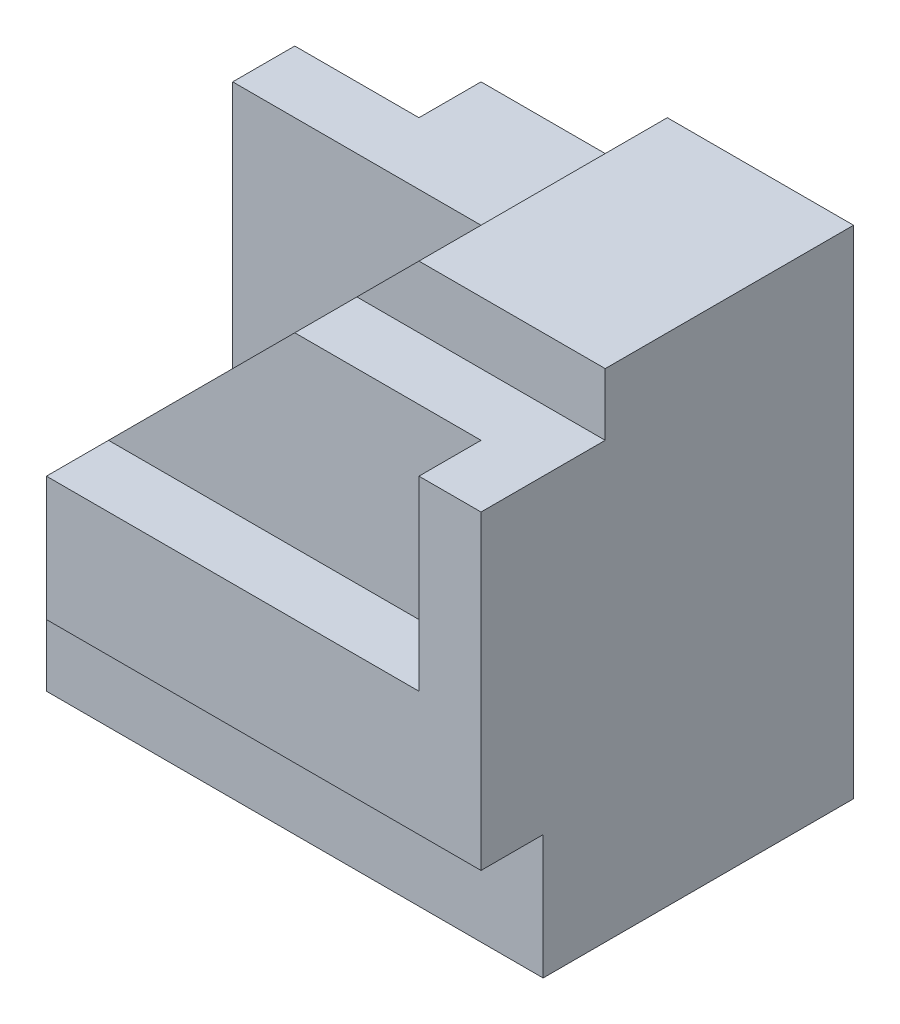
ISO-10303-21;
HEADER;
FILE_DESCRIPTION(('STEP AP214'),'2;1');
FILE_NAME('part.step','',(''),(''),'','','');
FILE_SCHEMA(('AUTOMOTIVE_DESIGN { 1 0 10303 214 1 1 1 1 }'));
ENDSEC;
DATA;
#1=APPLICATION_CONTEXT('core data for automotive mechanical design processes');
#2=APPLICATION_PROTOCOL_DEFINITION('international standard','automotive_design',2000,#1);
#3=PRODUCT_CONTEXT('',#1,'mechanical');
#4=PRODUCT('Part','Part','',(#3));
#5=PRODUCT_RELATED_PRODUCT_CATEGORY('part','',(#4));
#6=PRODUCT_DEFINITION_FORMATION('','',#4);
#7=PRODUCT_DEFINITION_CONTEXT('part definition',#1,'design');
#8=PRODUCT_DEFINITION('design','',#6,#7);
#9=PRODUCT_DEFINITION_SHAPE('','',#8);
#10=(LENGTH_UNIT() NAMED_UNIT(*) SI_UNIT(.MILLI.,.METRE.));
#11=(NAMED_UNIT(*) PLANE_ANGLE_UNIT() SI_UNIT($,.RADIAN.));
#12=(NAMED_UNIT(*) SI_UNIT($,.STERADIAN.) SOLID_ANGLE_UNIT());
#13=UNCERTAINTY_MEASURE_WITH_UNIT(LENGTH_MEASURE(1.E-05),#10,'distance_accuracy_value','');
#14=(GEOMETRIC_REPRESENTATION_CONTEXT(3) GLOBAL_UNCERTAINTY_ASSIGNED_CONTEXT((#13)) GLOBAL_UNIT_ASSIGNED_CONTEXT((#10,
#11,#12)) REPRESENTATION_CONTEXT('',''));
#15=CARTESIAN_POINT('',(0.,0.,0.));
#16=DIRECTION('',(0.,0.,1.));
#17=DIRECTION('',(1.,0.,0.));
#18=AXIS2_PLACEMENT_3D('',#15,#16,#17);
#19=CARTESIAN_POINT('',(-4.,8.,3.));
#20=DIRECTION('',(1.,0.,0.));
#21=DIRECTION('',(0.,0.,-1.));
#22=AXIS2_PLACEMENT_3D('',#19,#20,#21);
#23=PLANE('',#22);
#24=DIRECTION('',(0.,1.,0.));
#25=VECTOR('',#24,1.);
#26=CARTESIAN_POINT('',(-4.,2.,0.));
#27=LINE('',#26,#25);
#28=CARTESIAN_POINT('',(-4.,0.,0.));
#29=VERTEX_POINT('',#28);
#30=CARTESIAN_POINT('',(-4.,2.,0.));
#31=VERTEX_POINT('',#30);
#32=EDGE_CURVE('E289',#29,#31,#27,.T.);
#33=ORIENTED_EDGE('',*,*,#32,.F.);
#34=DIRECTION('',(0.,0.,1.));
#35=VECTOR('',#34,1.);
#36=CARTESIAN_POINT('',(-4.,0.,3.));
#37=LINE('',#36,#35);
#38=CARTESIAN_POINT('',(-4.,0.,2.));
#39=VERTEX_POINT('',#38);
#40=EDGE_CURVE('E273',#29,#39,#37,.T.);
#41=ORIENTED_EDGE('',*,*,#40,.T.);
#42=DIRECTION('',(0.,-1.,0.));
#43=VECTOR('',#42,1.);
#44=CARTESIAN_POINT('',(-4.,0.,2.));
#45=LINE('',#44,#43);
#46=CARTESIAN_POINT('',(-4.,2.,2.));
#47=VERTEX_POINT('',#46);
#48=EDGE_CURVE('E250',#47,#39,#45,.T.);
#49=ORIENTED_EDGE('',*,*,#48,.F.);
#50=DIRECTION('',(0.,0.,1.));
#51=VECTOR('',#50,1.);
#52=CARTESIAN_POINT('',(-4.,2.,3.));
#53=LINE('',#52,#51);
#54=EDGE_CURVE('E287',#31,#47,#53,.T.);
#55=ORIENTED_EDGE('',*,*,#54,.F.);
#56=EDGE_LOOP('',(#33,#41,#49,#55));
#57=FACE_BOUND('',#56,.T.);
#58=ADVANCED_FACE('F33',(#57),#23,.F.);
#59=CARTESIAN_POINT('',(-4.,8.,3.));
#60=DIRECTION('',(0.,0.,-1.));
#61=DIRECTION('',(-1.,0.,0.));
#62=AXIS2_PLACEMENT_3D('',#59,#60,#61);
#63=PLANE('',#62);
#64=DIRECTION('',(0.,1.,0.));
#65=VECTOR('',#64,1.);
#66=CARTESIAN_POINT('',(-3.,2.,3.));
#67=LINE('',#66,#65);
#68=CARTESIAN_POINT('',(-3.,2.,3.));
#69=VERTEX_POINT('',#68);
#70=CARTESIAN_POINT('',(-3.,4.,3.));
#71=VERTEX_POINT('',#70);
#72=EDGE_CURVE('E301',#69,#71,#67,.T.);
#73=ORIENTED_EDGE('',*,*,#72,.F.);
#74=DIRECTION('',(-1.,0.,0.));
#75=VECTOR('',#74,1.);
#76=CARTESIAN_POINT('',(4.,2.,3.));
#77=LINE('',#76,#75);
#78=CARTESIAN_POINT('',(4.,2.,3.));
#79=VERTEX_POINT('',#78);
#80=EDGE_CURVE('E257',#79,#69,#77,.T.);
#81=ORIENTED_EDGE('',*,*,#80,.F.);
#82=DIRECTION('',(0.,-1.,0.));
#83=VECTOR('',#82,1.);
#84=CARTESIAN_POINT('',(4.,8.,3.));
#85=LINE('',#84,#83);
#86=CARTESIAN_POINT('',(4.,7.,3.));
#87=VERTEX_POINT('',#86);
#88=EDGE_CURVE('E276',#87,#79,#85,.T.);
#89=ORIENTED_EDGE('',*,*,#88,.F.);
#90=DIRECTION('',(1.,0.,0.));
#91=VECTOR('',#90,1.);
#92=CARTESIAN_POINT('',(4.,7.,3.));
#93=LINE('',#92,#91);
#94=CARTESIAN_POINT('',(3.,7.,3.));
#95=VERTEX_POINT('',#94);
#96=EDGE_CURVE('E219',#95,#87,#93,.T.);
#97=ORIENTED_EDGE('',*,*,#96,.F.);
#98=DIRECTION('',(0.,1.,0.));
#99=VECTOR('',#98,1.);
#100=CARTESIAN_POINT('',(3.,8.,3.));
#101=LINE('',#100,#99);
#102=CARTESIAN_POINT('',(3.,4.,3.));
#103=VERTEX_POINT('',#102);
#104=EDGE_CURVE('E237',#103,#95,#101,.T.);
#105=ORIENTED_EDGE('',*,*,#104,.F.);
#106=DIRECTION('',(1.,0.,0.));
#107=VECTOR('',#106,1.);
#108=CARTESIAN_POINT('',(3.,4.,3.));
#109=LINE('',#108,#107);
#110=EDGE_CURVE('E242',#71,#103,#109,.T.);
#111=ORIENTED_EDGE('',*,*,#110,.F.);
#112=EDGE_LOOP('',(#73,#81,#89,#97,#105,#111));
#113=FACE_BOUND('',#112,.T.);
#114=ADVANCED_FACE('F410',(#113),#63,.F.);
#115=CARTESIAN_POINT('',(4.,2.,3.));
#116=DIRECTION('',(0.,1.,0.));
#117=DIRECTION('',(0.,0.,1.));
#118=AXIS2_PLACEMENT_3D('',#115,#116,#117);
#119=PLANE('',#118);
#120=DIRECTION('',(0.,0.,1.));
#121=VECTOR('',#120,1.);
#122=CARTESIAN_POINT('',(-3.,2.,3.));
#123=LINE('',#122,#121);
#124=CARTESIAN_POINT('',(-3.,2.,2.));
#125=VERTEX_POINT('',#124);
#126=EDGE_CURVE('E308',#125,#69,#123,.T.);
#127=ORIENTED_EDGE('',*,*,#126,.F.);
#128=DIRECTION('',(-1.,0.,0.));
#129=VECTOR('',#128,1.);
#130=CARTESIAN_POINT('',(4.,2.,2.));
#131=LINE('',#130,#129);
#132=CARTESIAN_POINT('',(4.,2.,2.));
#133=VERTEX_POINT('',#132);
#134=EDGE_CURVE('E264',#133,#125,#131,.T.);
#135=ORIENTED_EDGE('',*,*,#134,.F.);
#136=DIRECTION('',(0.,0.,-1.));
#137=VECTOR('',#136,1.);
#138=CARTESIAN_POINT('',(4.,2.,3.));
#139=LINE('',#138,#137);
#140=EDGE_CURVE('E251',#79,#133,#139,.T.);
#141=ORIENTED_EDGE('',*,*,#140,.F.);
#142=ORIENTED_EDGE('',*,*,#80,.T.);
#143=EDGE_LOOP('',(#127,#135,#141,#142));
#144=FACE_BOUND('',#143,.T.);
#145=ADVANCED_FACE('F407',(#144),#119,.F.);
#146=CARTESIAN_POINT('',(3.,4.,2.));
#147=DIRECTION('',(0.,-1.,0.));
#148=DIRECTION('',(0.,0.,-1.));
#149=AXIS2_PLACEMENT_3D('',#146,#147,#148);
#150=PLANE('',#149);
#151=DIRECTION('',(0.,0.,-1.));
#152=VECTOR('',#151,1.);
#153=CARTESIAN_POINT('',(-3.,4.,3.));
#154=LINE('',#153,#152);
#155=CARTESIAN_POINT('',(-3.,4.,2.));
#156=VERTEX_POINT('',#155);
#157=EDGE_CURVE('E303',#71,#156,#154,.T.);
#158=ORIENTED_EDGE('',*,*,#157,.F.);
#159=ORIENTED_EDGE('',*,*,#110,.T.);
#160=DIRECTION('',(0.,0.,1.));
#161=VECTOR('',#160,1.);
#162=CARTESIAN_POINT('',(3.,4.,2.));
#163=LINE('',#162,#161);
#164=CARTESIAN_POINT('',(3.,4.,2.));
#165=VERTEX_POINT('',#164);
#166=EDGE_CURVE('E244',#165,#103,#163,.T.);
#167=ORIENTED_EDGE('',*,*,#166,.F.);
#168=DIRECTION('',(1.,0.,0.));
#169=VECTOR('',#168,1.);
#170=CARTESIAN_POINT('',(3.,4.,2.));
#171=LINE('',#170,#169);
#172=EDGE_CURVE('E241',#156,#165,#171,.T.);
#173=ORIENTED_EDGE('',*,*,#172,.F.);
#174=EDGE_LOOP('',(#158,#159,#167,#173));
#175=FACE_BOUND('',#174,.T.);
#176=ADVANCED_FACE('F333',(#175),#150,.F.);
#177=CARTESIAN_POINT('',(0.,8.,0.));
#178=DIRECTION('',(0.,-1.,0.));
#179=DIRECTION('',(0.,0.,-1.));
#180=AXIS2_PLACEMENT_3D('',#177,#178,#179);
#181=PLANE('',#180);
#182=DIRECTION('',(-1.,0.,0.));
#183=VECTOR('',#182,1.);
#184=CARTESIAN_POINT('',(-4.,8.,-3.));
#185=LINE('',#184,#183);
#186=CARTESIAN_POINT('',(4.,8.,-3.));
#187=VERTEX_POINT('',#186);
#188=CARTESIAN_POINT('',(1.,8.,-3.));
#189=VERTEX_POINT('',#188);
#190=EDGE_CURVE('E272',#187,#189,#185,.T.);
#191=ORIENTED_EDGE('',*,*,#190,.T.);
#192=DIRECTION('',(0.,0.,1.));
#193=VECTOR('',#192,1.);
#194=CARTESIAN_POINT('',(1.,8.,-1.));
#195=LINE('',#194,#193);
#196=CARTESIAN_POINT('',(1.,8.,1.));
#197=VERTEX_POINT('',#196);
#198=EDGE_CURVE('E213',#189,#197,#195,.T.);
#199=ORIENTED_EDGE('',*,*,#198,.T.);
#200=DIRECTION('',(-1.,0.,0.));
#201=VECTOR('',#200,1.);
#202=CARTESIAN_POINT('',(4.,8.,1.));
#203=LINE('',#202,#201);
#204=CARTESIAN_POINT('',(4.,8.,1.));
#205=VERTEX_POINT('',#204);
#206=EDGE_CURVE('E224',#205,#197,#203,.T.);
#207=ORIENTED_EDGE('',*,*,#206,.F.);
#208=DIRECTION('',(0.,0.,-1.));
#209=VECTOR('',#208,1.);
#210=CARTESIAN_POINT('',(4.,8.,3.));
#211=LINE('',#210,#209);
#212=EDGE_CURVE('E270',#205,#187,#211,.T.);
#213=ORIENTED_EDGE('',*,*,#212,.T.);
#214=EDGE_LOOP('',(#191,#199,#207,#213));
#215=FACE_BOUND('',#214,.T.);
#216=ADVANCED_FACE('F346',(#215),#181,.F.);
#217=CARTESIAN_POINT('',(0.,0.,2.));
#218=DIRECTION('',(0.,0.,-1.));
#219=DIRECTION('',(-1.,0.,0.));
#220=AXIS2_PLACEMENT_3D('',#217,#218,#219);
#221=PLANE('',#220);
#222=DIRECTION('',(-1.,0.,0.));
#223=VECTOR('',#222,1.);
#224=CARTESIAN_POINT('',(0.,7.,2.));
#225=LINE('',#224,#223);
#226=CARTESIAN_POINT('',(3.,7.,2.));
#227=VERTEX_POINT('',#226);
#228=CARTESIAN_POINT('',(0.,7.,2.));
#229=VERTEX_POINT('',#228);
#230=EDGE_CURVE('E42',#227,#229,#225,.T.);
#231=ORIENTED_EDGE('',*,*,#230,.T.);
#232=DIRECTION('',(-0.707106781186548,-0.707106781186548,0.));
#233=VECTOR('',#232,1.);
#234=CARTESIAN_POINT('',(-3.5,3.5,2.));
#235=LINE('',#234,#233);
#236=EDGE_CURVE('E209',#229,#156,#235,.T.);
#237=ORIENTED_EDGE('',*,*,#236,.T.);
#238=ORIENTED_EDGE('',*,*,#172,.T.);
#239=DIRECTION('',(0.,1.,0.));
#240=VECTOR('',#239,1.);
#241=CARTESIAN_POINT('',(3.,8.,2.));
#242=LINE('',#241,#240);
#243=EDGE_CURVE('E238',#165,#227,#242,.T.);
#244=ORIENTED_EDGE('',*,*,#243,.T.);
#245=EDGE_LOOP('',(#231,#237,#238,#244));
#246=FACE_BOUND('',#245,.T.);
#247=ADVANCED_FACE('F337',(#246),#221,.F.);
#248=CARTESIAN_POINT('',(4.,8.,3.));
#249=DIRECTION('',(-1.,0.,0.));
#250=DIRECTION('',(0.,0.,1.));
#251=AXIS2_PLACEMENT_3D('',#248,#249,#250);
#252=PLANE('',#251);
#253=DIRECTION('',(0.,1.,0.));
#254=VECTOR('',#253,1.);
#255=CARTESIAN_POINT('',(4.,8.,1.));
#256=LINE('',#255,#254);
#257=CARTESIAN_POINT('',(4.,7.,1.));
#258=VERTEX_POINT('',#257);
#259=EDGE_CURVE('E222',#258,#205,#256,.T.);
#260=ORIENTED_EDGE('',*,*,#259,.F.);
#261=DIRECTION('',(0.,0.,1.));
#262=VECTOR('',#261,1.);
#263=CARTESIAN_POINT('',(4.,7.,1.));
#264=LINE('',#263,#262);
#265=EDGE_CURVE('E230',#258,#87,#264,.T.);
#266=ORIENTED_EDGE('',*,*,#265,.T.);
#267=ORIENTED_EDGE('',*,*,#88,.T.);
#268=ORIENTED_EDGE('',*,*,#140,.T.);
#269=DIRECTION('',(0.,-1.,0.));
#270=VECTOR('',#269,1.);
#271=CARTESIAN_POINT('',(4.,0.,2.));
#272=LINE('',#271,#270);
#273=CARTESIAN_POINT('',(4.,0.,2.));
#274=VERTEX_POINT('',#273);
#275=EDGE_CURVE('E254',#133,#274,#272,.T.);
#276=ORIENTED_EDGE('',*,*,#275,.T.);
#277=DIRECTION('',(0.,0.,-1.));
#278=VECTOR('',#277,1.);
#279=CARTESIAN_POINT('',(4.,0.,3.));
#280=LINE('',#279,#278);
#281=CARTESIAN_POINT('',(4.,0.,-3.));
#282=VERTEX_POINT('',#281);
#283=EDGE_CURVE('E263',#274,#282,#280,.T.);
#284=ORIENTED_EDGE('',*,*,#283,.T.);
#285=DIRECTION('',(0.,-1.,0.));
#286=VECTOR('',#285,1.);
#287=CARTESIAN_POINT('',(4.,8.,-3.));
#288=LINE('',#287,#286);
#289=EDGE_CURVE('E340',#187,#282,#288,.T.);
#290=ORIENTED_EDGE('',*,*,#289,.F.);
#291=ORIENTED_EDGE('',*,*,#212,.F.);
#292=EDGE_LOOP('',(#260,#266,#267,#268,#276,#284,#290,#291));
#293=FACE_BOUND('',#292,.T.);
#294=ADVANCED_FACE('F35',(#293),#252,.F.);
#295=CARTESIAN_POINT('',(-4.,8.,-3.));
#296=DIRECTION('',(0.,0.,1.));
#297=DIRECTION('',(1.,0.,0.));
#298=AXIS2_PLACEMENT_3D('',#295,#296,#297);
#299=PLANE('',#298);
#300=DIRECTION('',(0.,-1.,0.));
#301=VECTOR('',#300,1.);
#302=CARTESIAN_POINT('',(-5.,0.,-3.));
#303=LINE('',#302,#301);
#304=CARTESIAN_POINT('',(-5.,4.,-3.));
#305=VERTEX_POINT('',#304);
#306=CARTESIAN_POINT('',(-5.,0.,-3.));
#307=VERTEX_POINT('',#306);
#308=EDGE_CURVE('E293',#305,#307,#303,.T.);
#309=ORIENTED_EDGE('',*,*,#308,.F.);
#310=DIRECTION('',(-0.707106781186548,-0.707106781186548,0.));
#311=VECTOR('',#310,1.);
#312=CARTESIAN_POINT('',(-2.,7.,-3.));
#313=LINE('',#312,#311);
#314=CARTESIAN_POINT('',(-2.,7.,-3.));
#315=VERTEX_POINT('',#314);
#316=EDGE_CURVE('E358',#315,#305,#313,.T.);
#317=ORIENTED_EDGE('',*,*,#316,.F.);
#318=DIRECTION('',(-1.,0.,0.));
#319=VECTOR('',#318,1.);
#320=CARTESIAN_POINT('',(-2.,7.,-3.));
#321=LINE('',#320,#319);
#322=CARTESIAN_POINT('',(0.,7.,-3.));
#323=VERTEX_POINT('',#322);
#324=EDGE_CURVE('E195',#323,#315,#321,.T.);
#325=ORIENTED_EDGE('',*,*,#324,.F.);
#326=DIRECTION('',(0.707106781186547,0.707106781186548,0.));
#327=VECTOR('',#326,1.);
#328=CARTESIAN_POINT('',(0.,7.,-3.));
#329=LINE('',#328,#327);
#330=EDGE_CURVE('E183',#323,#189,#329,.T.);
#331=ORIENTED_EDGE('',*,*,#330,.T.);
#332=ORIENTED_EDGE('',*,*,#190,.F.);
#333=ORIENTED_EDGE('',*,*,#289,.T.);
#334=DIRECTION('',(-1.,0.,0.));
#335=VECTOR('',#334,1.);
#336=CARTESIAN_POINT('',(-4.,0.,-3.));
#337=LINE('',#336,#335);
#338=EDGE_CURVE('E278',#282,#307,#337,.T.);
#339=ORIENTED_EDGE('',*,*,#338,.T.);
#340=EDGE_LOOP('',(#309,#317,#325,#331,#332,#333,#339));
#341=FACE_BOUND('',#340,.T.);
#342=ADVANCED_FACE('F357',(#341),#299,.F.);
#343=CARTESIAN_POINT('',(0.,0.,0.));
#344=DIRECTION('',(0.,-1.,0.));
#345=DIRECTION('',(0.,0.,-1.));
#346=AXIS2_PLACEMENT_3D('',#343,#344,#345);
#347=PLANE('',#346);
#348=DIRECTION('',(-1.,0.,0.));
#349=VECTOR('',#348,1.);
#350=CARTESIAN_POINT('',(4.,0.,2.));
#351=LINE('',#350,#349);
#352=EDGE_CURVE('E260',#274,#39,#351,.T.);
#353=ORIENTED_EDGE('',*,*,#352,.T.);
#354=ORIENTED_EDGE('',*,*,#40,.F.);
#355=DIRECTION('',(1.,0.,0.));
#356=VECTOR('',#355,1.);
#357=CARTESIAN_POINT('',(-5.,0.,0.));
#358=LINE('',#357,#356);
#359=CARTESIAN_POINT('',(-5.,0.,0.));
#360=VERTEX_POINT('',#359);
#361=EDGE_CURVE('E382',#360,#29,#358,.T.);
#362=ORIENTED_EDGE('',*,*,#361,.F.);
#363=DIRECTION('',(0.,0.,1.));
#364=VECTOR('',#363,1.);
#365=CARTESIAN_POINT('',(-5.,0.,0.));
#366=LINE('',#365,#364);
#367=EDGE_CURVE('E375',#307,#360,#366,.T.);
#368=ORIENTED_EDGE('',*,*,#367,.F.);
#369=ORIENTED_EDGE('',*,*,#338,.F.);
#370=ORIENTED_EDGE('',*,*,#283,.F.);
#371=EDGE_LOOP('',(#353,#354,#362,#368,#369,#370));
#372=FACE_BOUND('',#371,.T.);
#373=ADVANCED_FACE('F399',(#372),#347,.T.);
#374=CARTESIAN_POINT('',(4.,0.,2.));
#375=DIRECTION('',(0.,0.,-1.));
#376=DIRECTION('',(-1.,0.,0.));
#377=AXIS2_PLACEMENT_3D('',#374,#375,#376);
#378=PLANE('',#377);
#379=ORIENTED_EDGE('',*,*,#48,.T.);
#380=ORIENTED_EDGE('',*,*,#352,.F.);
#381=ORIENTED_EDGE('',*,*,#275,.F.);
#382=ORIENTED_EDGE('',*,*,#134,.T.);
#383=EDGE_CURVE('E267',#125,#47,#131,.T.);
#384=ORIENTED_EDGE('',*,*,#383,.T.);
#385=EDGE_LOOP('',(#379,#380,#381,#382,#384));
#386=FACE_BOUND('',#385,.T.);
#387=ADVANCED_FACE('F395',(#386),#378,.F.);
#388=CARTESIAN_POINT('',(3.,8.,2.));
#389=DIRECTION('',(1.,0.,0.));
#390=DIRECTION('',(0.,1.,0.));
#391=AXIS2_PLACEMENT_3D('',#388,#389,#390);
#392=PLANE('',#391);
#393=ORIENTED_EDGE('',*,*,#104,.T.);
#394=DIRECTION('',(0.,0.,-1.));
#395=VECTOR('',#394,1.);
#396=CARTESIAN_POINT('',(3.,7.,2.));
#397=LINE('',#396,#395);
#398=EDGE_CURVE('E234',#95,#227,#397,.T.);
#399=ORIENTED_EDGE('',*,*,#398,.T.);
#400=ORIENTED_EDGE('',*,*,#243,.F.);
#401=ORIENTED_EDGE('',*,*,#166,.T.);
#402=EDGE_LOOP('',(#393,#399,#400,#401));
#403=FACE_BOUND('',#402,.T.);
#404=ADVANCED_FACE('F452',(#403),#392,.F.);
#405=CARTESIAN_POINT('',(4.,7.,1.));
#406=DIRECTION('',(0.,-1.,0.));
#407=DIRECTION('',(0.,0.,-1.));
#408=AXIS2_PLACEMENT_3D('',#405,#406,#407);
#409=PLANE('',#408);
#410=ORIENTED_EDGE('',*,*,#96,.T.);
#411=ORIENTED_EDGE('',*,*,#265,.F.);
#412=DIRECTION('',(1.,0.,0.));
#413=VECTOR('',#412,1.);
#414=CARTESIAN_POINT('',(4.,7.,1.));
#415=LINE('',#414,#413);
#416=CARTESIAN_POINT('',(0.,7.,1.));
#417=VERTEX_POINT('',#416);
#418=EDGE_CURVE('E227',#417,#258,#415,.T.);
#419=ORIENTED_EDGE('',*,*,#418,.F.);
#420=DIRECTION('',(0.,0.,-1.));
#421=VECTOR('',#420,1.);
#422=CARTESIAN_POINT('',(0.,7.,2.));
#423=LINE('',#422,#421);
#424=EDGE_CURVE('E206',#229,#417,#423,.T.);
#425=ORIENTED_EDGE('',*,*,#424,.F.);
#426=ORIENTED_EDGE('',*,*,#230,.F.);
#427=ORIENTED_EDGE('',*,*,#398,.F.);
#428=EDGE_LOOP('',(#410,#411,#419,#425,#426,#427));
#429=FACE_BOUND('',#428,.T.);
#430=ADVANCED_FACE('F342',(#429),#409,.F.);
#431=CARTESIAN_POINT('',(0.,0.,1.));
#432=DIRECTION('',(0.,0.,-1.));
#433=DIRECTION('',(-1.,0.,0.));
#434=AXIS2_PLACEMENT_3D('',#431,#432,#433);
#435=PLANE('',#434);
#436=ORIENTED_EDGE('',*,*,#259,.T.);
#437=ORIENTED_EDGE('',*,*,#206,.T.);
#438=DIRECTION('',(-0.707106781186548,-0.707106781186548,0.));
#439=VECTOR('',#438,1.);
#440=CARTESIAN_POINT('',(-3.5,3.5,1.));
#441=LINE('',#440,#439);
#442=EDGE_CURVE('E11',#197,#417,#441,.T.);
#443=ORIENTED_EDGE('',*,*,#442,.T.);
#444=ORIENTED_EDGE('',*,*,#418,.T.);
#445=EDGE_LOOP('',(#436,#437,#443,#444));
#446=FACE_BOUND('',#445,.T.);
#447=ADVANCED_FACE('F349',(#446),#435,.F.);
#448=CARTESIAN_POINT('',(-3.5,3.5,-1.));
#449=DIRECTION('',(-0.707106781186547,0.707106781186547,0.));
#450=DIRECTION('',(-0.707106781186548,-0.707106781186548,0.));
#451=AXIS2_PLACEMENT_3D('',#448,#449,#450);
#452=PLANE('',#451);
#453=ORIENTED_EDGE('',*,*,#442,.F.);
#454=ORIENTED_EDGE('',*,*,#198,.F.);
#455=ORIENTED_EDGE('',*,*,#330,.F.);
#456=DIRECTION('',(0.,0.,1.));
#457=VECTOR('',#456,1.);
#458=CARTESIAN_POINT('',(0.,7.,-3.));
#459=LINE('',#458,#457);
#460=CARTESIAN_POINT('',(0.,7.,-1.));
#461=VERTEX_POINT('',#460);
#462=EDGE_CURVE('E203',#323,#461,#459,.T.);
#463=ORIENTED_EDGE('',*,*,#462,.T.);
#464=DIRECTION('',(-0.707106781186548,-0.707106781186548,0.));
#465=VECTOR('',#464,1.);
#466=CARTESIAN_POINT('',(-3.5,3.5,-1.));
#467=LINE('',#466,#465);
#468=CARTESIAN_POINT('',(-3.,4.,-1.));
#469=VERTEX_POINT('',#468);
#470=EDGE_CURVE('E210',#461,#469,#467,.T.);
#471=ORIENTED_EDGE('',*,*,#470,.T.);
#472=DIRECTION('',(0.,0.,1.));
#473=VECTOR('',#472,1.);
#474=CARTESIAN_POINT('',(-3.,4.,-1.));
#475=LINE('',#474,#473);
#476=EDGE_CURVE('E216',#469,#156,#475,.T.);
#477=ORIENTED_EDGE('',*,*,#476,.T.);
#478=ORIENTED_EDGE('',*,*,#236,.F.);
#479=ORIENTED_EDGE('',*,*,#424,.T.);
#480=EDGE_LOOP('',(#453,#454,#455,#463,#471,#477,#478,#479));
#481=FACE_BOUND('',#480,.T.);
#482=ADVANCED_FACE('F322',(#481),#452,.T.);
#483=CARTESIAN_POINT('',(0.,0.,-1.));
#484=DIRECTION('',(0.,0.,1.));
#485=DIRECTION('',(1.,0.,0.));
#486=AXIS2_PLACEMENT_3D('',#483,#484,#485);
#487=PLANE('',#486);
#488=DIRECTION('',(0.,1.,0.));
#489=VECTOR('',#488,1.);
#490=CARTESIAN_POINT('',(-4.,2.,-1.));
#491=LINE('',#490,#489);
#492=CARTESIAN_POINT('',(-4.,2.,-1.));
#493=VERTEX_POINT('',#492);
#494=CARTESIAN_POINT('',(-4.,7.,-1.));
#495=VERTEX_POINT('',#494);
#496=EDGE_CURVE('E369',#493,#495,#491,.T.);
#497=ORIENTED_EDGE('',*,*,#496,.F.);
#498=DIRECTION('',(-1.,0.,0.));
#499=VECTOR('',#498,1.);
#500=CARTESIAN_POINT('',(-3.,2.,-1.));
#501=LINE('',#500,#499);
#502=CARTESIAN_POINT('',(-3.,2.,-1.));
#503=VERTEX_POINT('',#502);
#504=EDGE_CURVE('E311',#503,#493,#501,.T.);
#505=ORIENTED_EDGE('',*,*,#504,.F.);
#506=DIRECTION('',(0.,-1.,0.));
#507=VECTOR('',#506,1.);
#508=CARTESIAN_POINT('',(-3.,2.,-1.));
#509=LINE('',#508,#507);
#510=EDGE_CURVE('E305',#469,#503,#509,.T.);
#511=ORIENTED_EDGE('',*,*,#510,.F.);
#512=ORIENTED_EDGE('',*,*,#470,.F.);
#513=DIRECTION('',(1.,0.,0.));
#514=VECTOR('',#513,1.);
#515=CARTESIAN_POINT('',(0.,7.,-1.));
#516=LINE('',#515,#514);
#517=EDGE_CURVE('E197',#495,#461,#516,.T.);
#518=ORIENTED_EDGE('',*,*,#517,.F.);
#519=EDGE_LOOP('',(#497,#505,#511,#512,#518));
#520=FACE_BOUND('',#519,.T.);
#521=ADVANCED_FACE('F323',(#520),#487,.T.);
#522=CARTESIAN_POINT('',(-4.,7.,-2.));
#523=DIRECTION('',(0.,0.,-1.));
#524=DIRECTION('',(-1.,0.,0.));
#525=AXIS2_PLACEMENT_3D('',#522,#523,#524);
#526=PLANE('',#525);
#527=DIRECTION('',(0.,1.,0.));
#528=VECTOR('',#527,1.);
#529=CARTESIAN_POINT('',(-4.,2.,-2.));
#530=LINE('',#529,#528);
#531=CARTESIAN_POINT('',(-4.,2.,-2.));
#532=VERTEX_POINT('',#531);
#533=CARTESIAN_POINT('',(-4.,5.,-2.));
#534=VERTEX_POINT('',#533);
#535=EDGE_CURVE('E294',#532,#534,#530,.T.);
#536=ORIENTED_EDGE('',*,*,#535,.T.);
#537=DIRECTION('',(-0.707106781186548,-0.707106781186548,0.));
#538=VECTOR('',#537,1.);
#539=CARTESIAN_POINT('',(-2.,7.,-2.));
#540=LINE('',#539,#538);
#541=CARTESIAN_POINT('',(-5.,4.,-2.));
#542=VERTEX_POINT('',#541);
#543=EDGE_CURVE('E189',#534,#542,#540,.T.);
#544=ORIENTED_EDGE('',*,*,#543,.T.);
#545=DIRECTION('',(0.,1.,0.));
#546=VECTOR('',#545,1.);
#547=CARTESIAN_POINT('',(-5.,8.,-2.));
#548=LINE('',#547,#546);
#549=CARTESIAN_POINT('',(-5.,2.,-2.));
#550=VERTEX_POINT('',#549);
#551=EDGE_CURVE('E58',#550,#542,#548,.T.);
#552=ORIENTED_EDGE('',*,*,#551,.F.);
#553=DIRECTION('',(-1.,0.,0.));
#554=VECTOR('',#553,1.);
#555=CARTESIAN_POINT('',(-5.,2.,-2.));
#556=LINE('',#555,#554);
#557=EDGE_CURVE('E366',#532,#550,#556,.T.);
#558=ORIENTED_EDGE('',*,*,#557,.F.);
#559=EDGE_LOOP('',(#536,#544,#552,#558));
#560=FACE_BOUND('',#559,.T.);
#561=ADVANCED_FACE('F414',(#560),#526,.F.);
#562=CARTESIAN_POINT('',(0.,7.,0.));
#563=DIRECTION('',(0.,-1.,0.));
#564=DIRECTION('',(0.,0.,-1.));
#565=AXIS2_PLACEMENT_3D('',#562,#563,#564);
#566=PLANE('',#565);
#567=DIRECTION('',(-1.,0.,0.));
#568=VECTOR('',#567,1.);
#569=CARTESIAN_POINT('',(-4.,7.,-2.));
#570=LINE('',#569,#568);
#571=CARTESIAN_POINT('',(-2.,7.,-2.));
#572=VERTEX_POINT('',#571);
#573=CARTESIAN_POINT('',(-4.,7.,-2.));
#574=VERTEX_POINT('',#573);
#575=EDGE_CURVE('E175',#572,#574,#570,.T.);
#576=ORIENTED_EDGE('',*,*,#575,.T.);
#577=DIRECTION('',(0.,0.,-1.));
#578=VECTOR('',#577,1.);
#579=CARTESIAN_POINT('',(-4.,7.,-2.));
#580=LINE('',#579,#578);
#581=EDGE_CURVE('E316',#495,#574,#580,.T.);
#582=ORIENTED_EDGE('',*,*,#581,.F.);
#583=ORIENTED_EDGE('',*,*,#517,.T.);
#584=ORIENTED_EDGE('',*,*,#462,.F.);
#585=ORIENTED_EDGE('',*,*,#324,.T.);
#586=DIRECTION('',(0.,0.,1.));
#587=VECTOR('',#586,1.);
#588=CARTESIAN_POINT('',(-2.,7.,-2.));
#589=LINE('',#588,#587);
#590=EDGE_CURVE('E184',#315,#572,#589,.T.);
#591=ORIENTED_EDGE('',*,*,#590,.T.);
#592=EDGE_LOOP('',(#576,#582,#583,#584,#585,#591));
#593=FACE_BOUND('',#592,.T.);
#594=ADVANCED_FACE('F193',(#593),#566,.F.);
#595=CARTESIAN_POINT('',(-3.,2.,3.));
#596=DIRECTION('',(0.,-1.,0.));
#597=DIRECTION('',(0.,0.,-1.));
#598=AXIS2_PLACEMENT_3D('',#595,#596,#597);
#599=PLANE('',#598);
#600=EDGE_CURVE('E309',#503,#125,#123,.T.);
#601=ORIENTED_EDGE('',*,*,#600,.F.);
#602=ORIENTED_EDGE('',*,*,#504,.T.);
#603=DIRECTION('',(0.,0.,-1.));
#604=VECTOR('',#603,1.);
#605=CARTESIAN_POINT('',(-4.,2.,-2.));
#606=LINE('',#605,#604);
#607=EDGE_CURVE('E363',#493,#532,#606,.T.);
#608=ORIENTED_EDGE('',*,*,#607,.T.);
#609=ORIENTED_EDGE('',*,*,#557,.T.);
#610=DIRECTION('',(0.,0.,-1.));
#611=VECTOR('',#610,1.);
#612=CARTESIAN_POINT('',(-5.,2.,-1.));
#613=LINE('',#612,#611);
#614=CARTESIAN_POINT('',(-5.,2.,0.));
#615=VERTEX_POINT('',#614);
#616=EDGE_CURVE('E378',#615,#550,#613,.T.);
#617=ORIENTED_EDGE('',*,*,#616,.F.);
#618=DIRECTION('',(1.,0.,0.));
#619=VECTOR('',#618,1.);
#620=CARTESIAN_POINT('',(-5.,2.,0.));
#621=LINE('',#620,#619);
#622=EDGE_CURVE('E295',#615,#31,#621,.T.);
#623=ORIENTED_EDGE('',*,*,#622,.T.);
#624=ORIENTED_EDGE('',*,*,#54,.T.);
#625=ORIENTED_EDGE('',*,*,#383,.F.);
#626=EDGE_LOOP('',(#601,#602,#608,#609,#617,#623,#624,#625));
#627=FACE_BOUND('',#626,.T.);
#628=ADVANCED_FACE('F391',(#627),#599,.F.);
#629=CARTESIAN_POINT('',(-3.,0.,0.));
#630=DIRECTION('',(-1.,0.,0.));
#631=DIRECTION('',(0.,0.,1.));
#632=AXIS2_PLACEMENT_3D('',#629,#630,#631);
#633=PLANE('',#632);
#634=ORIENTED_EDGE('',*,*,#72,.T.);
#635=ORIENTED_EDGE('',*,*,#157,.T.);
#636=ORIENTED_EDGE('',*,*,#476,.F.);
#637=ORIENTED_EDGE('',*,*,#510,.T.);
#638=ORIENTED_EDGE('',*,*,#600,.T.);
#639=ORIENTED_EDGE('',*,*,#126,.T.);
#640=EDGE_LOOP('',(#634,#635,#636,#637,#638,#639));
#641=FACE_BOUND('',#640,.T.);
#642=ADVANCED_FACE('F327',(#641),#633,.T.);
#643=CARTESIAN_POINT('',(-5.,2.,0.));
#644=DIRECTION('',(0.,0.,-1.));
#645=DIRECTION('',(-1.,0.,0.));
#646=AXIS2_PLACEMENT_3D('',#643,#644,#645);
#647=PLANE('',#646);
#648=ORIENTED_EDGE('',*,*,#32,.T.);
#649=ORIENTED_EDGE('',*,*,#622,.F.);
#650=DIRECTION('',(0.,1.,0.));
#651=VECTOR('',#650,1.);
#652=CARTESIAN_POINT('',(-5.,2.,0.));
#653=LINE('',#652,#651);
#654=EDGE_CURVE('E377',#360,#615,#653,.T.);
#655=ORIENTED_EDGE('',*,*,#654,.F.);
#656=ORIENTED_EDGE('',*,*,#361,.T.);
#657=EDGE_LOOP('',(#648,#649,#655,#656));
#658=FACE_BOUND('',#657,.T.);
#659=ADVANCED_FACE('F424',(#658),#647,.F.);
#660=CARTESIAN_POINT('',(-5.,0.,0.));
#661=DIRECTION('',(1.,0.,0.));
#662=DIRECTION('',(0.,0.,-1.));
#663=AXIS2_PLACEMENT_3D('',#660,#661,#662);
#664=PLANE('',#663);
#665=ORIENTED_EDGE('',*,*,#551,.T.);
#666=DIRECTION('',(0.,0.,-1.));
#667=VECTOR('',#666,1.);
#668=CARTESIAN_POINT('',(-5.,4.,-2.));
#669=LINE('',#668,#667);
#670=EDGE_CURVE('E190',#542,#305,#669,.T.);
#671=ORIENTED_EDGE('',*,*,#670,.T.);
#672=ORIENTED_EDGE('',*,*,#308,.T.);
#673=ORIENTED_EDGE('',*,*,#367,.T.);
#674=ORIENTED_EDGE('',*,*,#654,.T.);
#675=ORIENTED_EDGE('',*,*,#616,.T.);
#676=EDGE_LOOP('',(#665,#671,#672,#673,#674,#675));
#677=FACE_BOUND('',#676,.T.);
#678=ADVANCED_FACE('F417',(#677),#664,.F.);
#679=CARTESIAN_POINT('',(-4.,2.,-2.));
#680=DIRECTION('',(1.,0.,0.));
#681=DIRECTION('',(0.,0.,-1.));
#682=AXIS2_PLACEMENT_3D('',#679,#680,#681);
#683=PLANE('',#682);
#684=ORIENTED_EDGE('',*,*,#581,.T.);
#685=EDGE_CURVE('E178',#534,#574,#530,.T.);
#686=ORIENTED_EDGE('',*,*,#685,.F.);
#687=ORIENTED_EDGE('',*,*,#535,.F.);
#688=ORIENTED_EDGE('',*,*,#607,.F.);
#689=ORIENTED_EDGE('',*,*,#496,.T.);
#690=EDGE_LOOP('',(#684,#686,#687,#688,#689));
#691=FACE_BOUND('',#690,.T.);
#692=ADVANCED_FACE('F415',(#691),#683,.F.);
#693=CARTESIAN_POINT('',(0.,0.,-2.));
#694=DIRECTION('',(0.,0.,1.));
#695=DIRECTION('',(1.,0.,0.));
#696=AXIS2_PLACEMENT_3D('',#693,#694,#695);
#697=PLANE('',#696);
#698=EDGE_CURVE('E50',#572,#534,#540,.T.);
#699=ORIENTED_EDGE('',*,*,#698,.T.);
#700=ORIENTED_EDGE('',*,*,#685,.T.);
#701=ORIENTED_EDGE('',*,*,#575,.F.);
#702=EDGE_LOOP('',(#699,#700,#701));
#703=FACE_BOUND('',#702,.T.);
#704=ADVANCED_FACE('F176',(#703),#697,.F.);
#705=CARTESIAN_POINT('',(-2.,7.,-2.));
#706=DIRECTION('',(0.707106781186547,-0.707106781186547,0.));
#707=DIRECTION('',(0.707106781186548,0.707106781186548,0.));
#708=AXIS2_PLACEMENT_3D('',#705,#706,#707);
#709=PLANE('',#708);
#710=ORIENTED_EDGE('',*,*,#316,.T.);
#711=ORIENTED_EDGE('',*,*,#670,.F.);
#712=ORIENTED_EDGE('',*,*,#543,.F.);
#713=ORIENTED_EDGE('',*,*,#698,.F.);
#714=ORIENTED_EDGE('',*,*,#590,.F.);
#715=EDGE_LOOP('',(#710,#711,#712,#713,#714));
#716=FACE_BOUND('',#715,.T.);
#717=ADVANCED_FACE('F187',(#716),#709,.F.);
#718=CLOSED_SHELL('',(#58,#114,#145,#176,#216,#247,#294,#342,#373,#387,#404,#430,#447,#482,#521,
#561,#594,#628,#642,#659,#678,#692,#704,#717));
#719=MANIFOLD_SOLID_BREP('B2',#718);
#720=ADVANCED_BREP_SHAPE_REPRESENTATION('',(#18,#719),#14);
#721=SHAPE_DEFINITION_REPRESENTATION(#9,#720);
ENDSEC;
END-ISO-10303-21;
